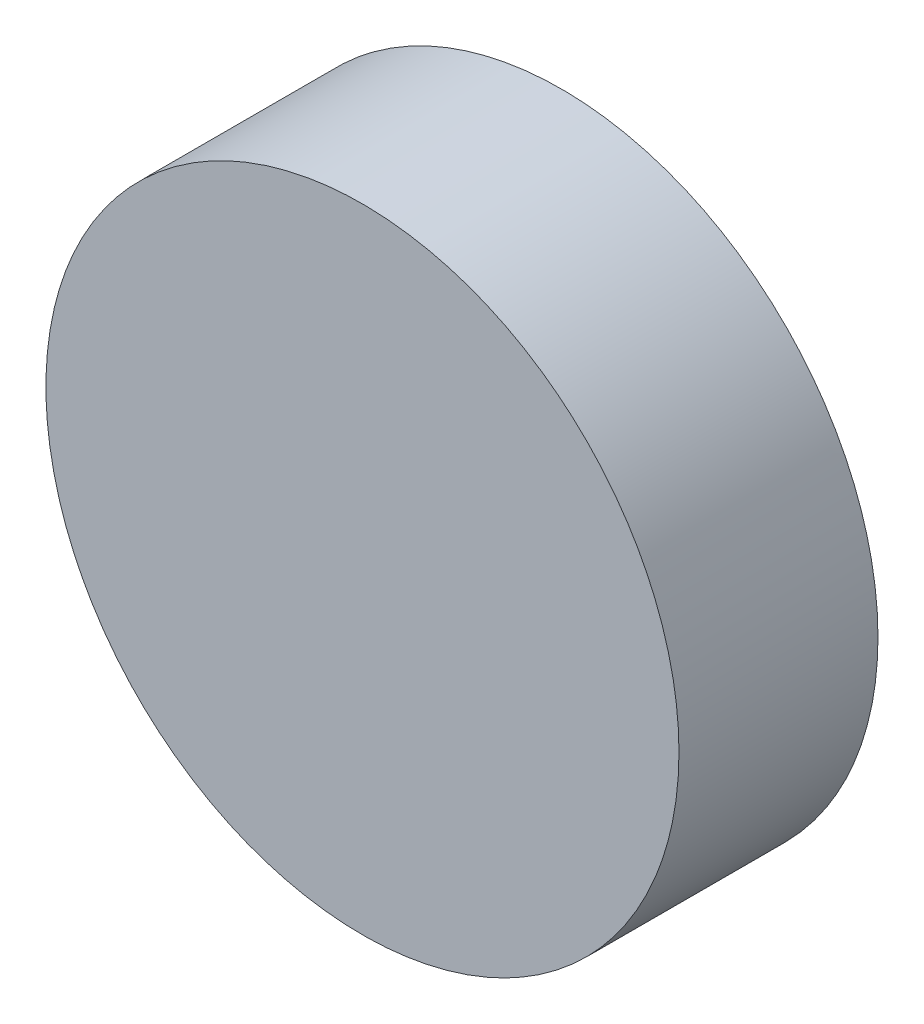
ISO-10303-21;
HEADER;
FILE_DESCRIPTION(('STEP AP214'),'2;1');
FILE_NAME('part.step','',(''),(''),'','','');
FILE_SCHEMA(('AUTOMOTIVE_DESIGN { 1 0 10303 214 1 1 1 1 }'));
ENDSEC;
DATA;
#1=APPLICATION_CONTEXT('core data for automotive mechanical design processes');
#2=APPLICATION_PROTOCOL_DEFINITION('international standard','automotive_design',2000,#1);
#3=PRODUCT_CONTEXT('',#1,'mechanical');
#4=PRODUCT('Part','Part','',(#3));
#5=PRODUCT_RELATED_PRODUCT_CATEGORY('part','',(#4));
#6=PRODUCT_DEFINITION_FORMATION('','',#4);
#7=PRODUCT_DEFINITION_CONTEXT('part definition',#1,'design');
#8=PRODUCT_DEFINITION('design','',#6,#7);
#9=PRODUCT_DEFINITION_SHAPE('','',#8);
#10=(LENGTH_UNIT() NAMED_UNIT(*) SI_UNIT(.MILLI.,.METRE.));
#11=(NAMED_UNIT(*) PLANE_ANGLE_UNIT() SI_UNIT($,.RADIAN.));
#12=(NAMED_UNIT(*) SI_UNIT($,.STERADIAN.) SOLID_ANGLE_UNIT());
#13=UNCERTAINTY_MEASURE_WITH_UNIT(LENGTH_MEASURE(1.E-05),#10,'distance_accuracy_value','');
#14=(GEOMETRIC_REPRESENTATION_CONTEXT(3) GLOBAL_UNCERTAINTY_ASSIGNED_CONTEXT((#13)) GLOBAL_UNIT_ASSIGNED_CONTEXT((#10,
#11,#12)) REPRESENTATION_CONTEXT('',''));
#15=CARTESIAN_POINT('',(0.,0.,0.));
#16=DIRECTION('',(0.,0.,1.));
#17=DIRECTION('',(1.,0.,0.));
#18=AXIS2_PLACEMENT_3D('',#15,#16,#17);
#19=CARTESIAN_POINT('',(711.068615126559,947.806636218316,1405.60786347206));
#20=CARTESIAN_POINT('',(711.068615126559,948.075804185048,1405.60786347206));
#21=CARTESIAN_POINT('',(710.961533451588,948.614140118513,1405.60786347206));
#22=CARTESIAN_POINT('',(710.504119235694,949.298708869946,1405.60786347206));
#23=CARTESIAN_POINT('',(709.819550484261,949.75612308584,1405.60786347206));
#24=CARTESIAN_POINT('',(709.012046584064,949.916745598296,1405.60786347206));
#25=CARTESIAN_POINT('',(708.204542683868,949.75612308584,1405.60786347206));
#26=CARTESIAN_POINT('',(707.519973932435,949.298708869945,1405.60786347206));
#27=CARTESIAN_POINT('',(707.06255971654,948.614140118513,1405.60786347206));
#28=CARTESIAN_POINT('',(706.901937204084,947.806636218316,1405.60786347206));
#29=CARTESIAN_POINT('',(707.06255971654,946.999132318119,1405.60786347206));
#30=CARTESIAN_POINT('',(707.519973932435,946.314563566687,1405.60786347206));
#31=CARTESIAN_POINT('',(708.204542683868,945.857149350792,1405.60786347206));
#32=CARTESIAN_POINT('',(709.012046584064,945.696526838336,1405.60786347206));
#33=CARTESIAN_POINT('',(709.819550484261,945.857149350792,1405.60786347206));
#34=CARTESIAN_POINT('',(710.504119235694,946.314563566687,1405.60786347206));
#35=CARTESIAN_POINT('',(710.961533451588,946.999132318119,1405.60786347206));
#36=CARTESIAN_POINT('',(711.068615126559,947.537468251584,1405.60786347206));
#37=CARTESIAN_POINT('',(711.068615126559,947.806636218316,1405.60786347206));
#38=B_SPLINE_CURVE_WITH_KNOTS('',3,(#19,#20,#21,#22,#23,#24,#25,#26,#27,#28,#29,#30,#31,#32,#33,
#34,#35,#36,#37),.UNSPECIFIED.,.T.,.F.,(4,1,1,1,1,1,1,1,1,1,1,1,1,1,1,1,4),(0.,
0.0624999999999959,0.125,0.187500000000004,0.25,0.312499999999996,0.375,0.437500000000004,0.5,
0.562499999999996,0.625,0.687500000000004,0.75,0.812499999999996,0.875,0.937500000000004,1.),.UNSPECIFIED.);
#39=DIRECTION('',(0.,0.,1.));
#40=VECTOR('',#39,1.);
#41=SURFACE_OF_LINEAR_EXTRUSION('',#38,#40);
#42=CARTESIAN_POINT('',(711.068615126559,947.806636218316,1405.60786347206));
#43=CARTESIAN_POINT('',(711.068615126559,948.075804185048,1405.60786347206));
#44=CARTESIAN_POINT('',(710.961533451588,948.614140118513,1405.60786347206));
#45=CARTESIAN_POINT('',(710.504119235694,949.298708869946,1405.60786347206));
#46=CARTESIAN_POINT('',(709.819550484261,949.75612308584,1405.60786347206));
#47=CARTESIAN_POINT('',(709.012046584064,949.916745598296,1405.60786347206));
#48=CARTESIAN_POINT('',(708.204542683868,949.75612308584,1405.60786347206));
#49=CARTESIAN_POINT('',(707.519973932435,949.298708869945,1405.60786347206));
#50=CARTESIAN_POINT('',(707.06255971654,948.614140118513,1405.60786347206));
#51=CARTESIAN_POINT('',(706.901937204084,947.806636218316,1405.60786347206));
#52=CARTESIAN_POINT('',(707.06255971654,946.999132318119,1405.60786347206));
#53=CARTESIAN_POINT('',(707.519973932435,946.314563566687,1405.60786347206));
#54=CARTESIAN_POINT('',(708.204542683868,945.857149350792,1405.60786347206));
#55=CARTESIAN_POINT('',(709.012046584064,945.696526838336,1405.60786347206));
#56=CARTESIAN_POINT('',(709.819550484261,945.857149350792,1405.60786347206));
#57=CARTESIAN_POINT('',(710.504119235694,946.314563566687,1405.60786347206));
#58=CARTESIAN_POINT('',(710.961533451588,946.999132318119,1405.60786347206));
#59=CARTESIAN_POINT('',(711.068615126559,947.537468251584,1405.60786347206));
#60=CARTESIAN_POINT('',(711.068615126559,947.806636218316,1405.60786347206));
#61=B_SPLINE_CURVE_WITH_KNOTS('',3,(#42,#43,#44,#45,#46,#47,#48,#49,#50,#51,#52,#53,#54,#55,#56,
#57,#58,#59,#60),.UNSPECIFIED.,.T.,.F.,(4,1,1,1,1,1,1,1,1,1,1,1,1,1,1,1,4),(0.,
0.0624999999999959,0.125,0.187500000000004,0.25,0.312499999999996,0.375,0.437500000000004,0.5,
0.562499999999996,0.625,0.687500000000004,0.75,0.812499999999996,0.875,0.937500000000004,1.),.UNSPECIFIED.);
#62=CARTESIAN_POINT('',(711.068615126559,947.806636218316,1405.60786347206));
#63=VERTEX_POINT('',#62);
#64=EDGE_CURVE('E9',#63,#63,#61,.T.);
#65=ORIENTED_EDGE('',*,*,#64,.T.);
#66=EDGE_LOOP('',(#65));
#67=FACE_BOUND('',#66,.T.);
#68=CARTESIAN_POINT('',(711.068615126559,947.806636218316,1406.90071720146));
#69=CARTESIAN_POINT('',(711.068615150918,947.772989428573,1406.90071720146));
#70=CARTESIAN_POINT('',(711.067778514408,947.739343337211,1406.90071720146));
#71=CARTESIAN_POINT('',(711.064448107361,947.672131183194,1406.90071720146));
#72=CARTESIAN_POINT('',(711.061954239332,947.638565125364,1406.90071720146));
#73=CARTESIAN_POINT('',(711.055325333316,947.571593350349,1406.90071720146));
#74=CARTESIAN_POINT('',(711.051190182706,947.538187644325,1406.90071720146));
#75=CARTESIAN_POINT('',(711.041294618915,947.471616400879,1406.90071720146));
#76=CARTESIAN_POINT('',(711.035534135638,947.438450873878,1406.90071720146));
#77=CARTESIAN_POINT('',(711.022403749647,947.372439960422,1406.90071720146));
#78=CARTESIAN_POINT('',(711.015033846935,947.339594573966,1406.90071720146));
#79=CARTESIAN_POINT('',(710.998700436974,947.274303883513,1406.90071720146));
#80=CARTESIAN_POINT('',(710.989736998474,947.241858562319,1406.90071720146));
#81=CARTESIAN_POINT('',(710.970232345742,947.177447989482,1406.90071720146));
#82=CARTESIAN_POINT('',(710.959691239826,947.145482705046,1406.90071720146));
#83=CARTESIAN_POINT('',(710.937047062175,947.082112085445,1406.90071720146));
#84=CARTESIAN_POINT('',(710.924944082366,947.050706717449,1406.90071720146));
#85=CARTESIAN_POINT('',(710.899192252998,946.98853630171,1406.90071720146));
#86=CARTESIAN_POINT('',(710.88554340344,946.957771253966,1406.90071720146));
#87=CARTESIAN_POINT('',(710.856745460104,946.8969496075,1406.90071720146));
#88=CARTESIAN_POINT('',(710.841596278108,946.866893050564,1406.90071720146));
#89=CARTESIAN_POINT('',(710.809842997711,946.807556025715,1406.90071720146));
#90=CARTESIAN_POINT('',(710.793238799529,946.778275611207,1406.90071720146));
#91=CARTESIAN_POINT('',(710.758620773669,946.720558655556,1406.90071720146));
#92=CARTESIAN_POINT('',(710.740606885219,946.692122150867,1406.90071720146));
#93=CARTESIAN_POINT('',(710.703214708772,946.636160804118,1406.90071720146));
#94=CARTESIAN_POINT('',(710.683836420776,946.60863596206,1406.90071720146));
#95=CARTESIAN_POINT('',(710.643760651728,946.554565753817,1406.90071720146));
#96=CARTESIAN_POINT('',(710.623063227613,946.528020345438,1406.90071720146));
#97=CARTESIAN_POINT('',(710.580394419168,946.475976843253,1406.90071720146));
#98=CARTESIAN_POINT('',(710.558423122362,946.450478677701,1406.90071720146));
#99=CARTESIAN_POINT('',(710.513251743854,946.40059741084,1406.90071720146));
#100=CARTESIAN_POINT('',(710.490051734516,946.376214244021,1406.90071720146));
#101=CARTESIAN_POINT('',(710.442468558359,946.328631067864,1406.90071720146));
#102=CARTESIAN_POINT('',(710.41808539154,946.305431058526,1406.90071720146));
#103=CARTESIAN_POINT('',(710.368204124679,946.260259680018,1406.90071720146));
#104=CARTESIAN_POINT('',(710.342705959127,946.238288383212,1406.90071720146));
#105=CARTESIAN_POINT('',(710.290662456942,946.195619574768,1406.90071720146));
#106=CARTESIAN_POINT('',(710.264117048563,946.174922150652,1406.90071720146));
#107=CARTESIAN_POINT('',(710.21004684032,946.134846381604,1406.90071720146));
#108=CARTESIAN_POINT('',(710.182521998262,946.115468093608,1406.90071720146));
#109=CARTESIAN_POINT('',(710.126560651514,946.078075917161,1406.90071720146));
#110=CARTESIAN_POINT('',(710.098124146824,946.060062028711,1406.90071720146));
#111=CARTESIAN_POINT('',(710.040407191172,946.025444002851,1406.90071720146));
#112=CARTESIAN_POINT('',(710.011126776664,946.008839804669,1406.90071720146));
#113=CARTESIAN_POINT('',(709.951789751817,945.977086524271,1406.90071720146));
#114=CARTESIAN_POINT('',(709.921733194883,945.961937342276,1406.90071720146));
#115=CARTESIAN_POINT('',(709.860911548411,945.93313939894,1406.90071720146));
#116=CARTESIAN_POINT('',(709.830146500659,945.919490549383,1406.90071720146));
#117=CARTESIAN_POINT('',(709.767976084941,945.893738720014,1406.90071720146));
#118=CARTESIAN_POINT('',(709.736570716975,945.881635740202,1406.90071720146));
#119=CARTESIAN_POINT('',(709.673200097294,945.858991562556,1406.90071720146));
#120=CARTESIAN_POINT('',(709.641234812749,945.848450456647,1406.90071720146));
#121=CARTESIAN_POINT('',(709.57682424021,945.828945803897,1406.90071720146));
#122=CARTESIAN_POINT('',(709.544378919425,945.819982365373,1406.90071720146));
#123=CARTESIAN_POINT('',(709.479088227857,945.803648955479,1406.90071720146));
#124=CARTESIAN_POINT('',(709.446242839879,945.796279052858,1406.90071720146));
#125=CARTESIAN_POINT('',(709.380231930581,945.783148666617,1406.90071720146));
#126=CARTESIAN_POINT('',(709.34706640926,945.777388182996,1406.90071720146));
#127=CARTESIAN_POINT('',(709.280495150296,945.767492620142,1406.90071720146));
#128=CARTESIAN_POINT('',(709.247089423077,945.763357470814,1406.90071720146));
#129=CARTESIAN_POINT('',(709.180117705969,945.756728561299,1406.90071720146));
#130=CARTESIAN_POINT('',(709.146551727237,945.754234688492,1406.90071720146));
#131=CARTESIAN_POINT('',(709.079339357126,945.750904294499,1406.90071720146));
#132=CARTESIAN_POINT('',(709.045692970595,945.750067675821,1406.90071720146));
#133=CARTESIAN_POINT('',(708.978400197533,945.750067675821,1406.90071720146));
#134=CARTESIAN_POINT('',(708.944753811002,945.750904294499,1406.90071720146));
#135=CARTESIAN_POINT('',(708.877541440892,945.754234688492,1406.90071720146));
#136=CARTESIAN_POINT('',(708.84397546216,945.756728561299,1406.90071720146));
#137=CARTESIAN_POINT('',(708.777003745052,945.763357470814,1406.90071720146));
#138=CARTESIAN_POINT('',(708.743598017832,945.767492620143,1406.90071720146));
#139=CARTESIAN_POINT('',(708.677026758869,945.777388182997,1406.90071720146));
#140=CARTESIAN_POINT('',(708.643861237548,945.783148666617,1406.90071720146));
#141=CARTESIAN_POINT('',(708.577850328249,945.796279052858,1406.90071720146));
#142=CARTESIAN_POINT('',(708.545004940272,945.803648955479,1406.90071720146));
#143=CARTESIAN_POINT('',(708.479714248704,945.819982365373,1406.90071720146));
#144=CARTESIAN_POINT('',(708.447268927919,945.828945803897,1406.90071720146));
#145=CARTESIAN_POINT('',(708.38285835538,945.848450456648,1406.90071720146));
#146=CARTESIAN_POINT('',(708.350893070834,945.858991562557,1406.90071720146));
#147=CARTESIAN_POINT('',(708.287522451153,945.881635740203,1406.90071720146));
#148=CARTESIAN_POINT('',(708.256117083187,945.893738720014,1406.90071720146));
#149=CARTESIAN_POINT('',(708.193946667469,945.919490549383,1406.90071720146));
#150=CARTESIAN_POINT('',(708.163181619718,945.93313939894,1406.90071720146));
#151=CARTESIAN_POINT('',(708.102359973246,945.961937342276,1406.90071720146));
#152=CARTESIAN_POINT('',(708.072303416311,945.977086524272,1406.90071720146));
#153=CARTESIAN_POINT('',(708.012966391464,946.008839804669,1406.90071720146));
#154=CARTESIAN_POINT('',(707.983685976956,946.025444002851,1406.90071720146));
#155=CARTESIAN_POINT('',(707.925969021305,946.060062028712,1406.90071720146));
#156=CARTESIAN_POINT('',(707.897532516615,946.078075917161,1406.90071720146));
#157=CARTESIAN_POINT('',(707.841571169867,946.115468093608,1406.90071720146));
#158=CARTESIAN_POINT('',(707.814046327808,946.134846381604,1406.90071720146));
#159=CARTESIAN_POINT('',(707.759976119565,946.174922150652,1406.90071720146));
#160=CARTESIAN_POINT('',(707.733430711186,946.195619574768,1406.90071720146));
#161=CARTESIAN_POINT('',(707.681387209002,946.238288383212,1406.90071720146));
#162=CARTESIAN_POINT('',(707.655889043449,946.260259680018,1406.90071720146));
#163=CARTESIAN_POINT('',(707.606007776589,946.305431058526,1406.90071720146));
#164=CARTESIAN_POINT('',(707.58162460977,946.328631067864,1406.90071720146));
#165=CARTESIAN_POINT('',(707.534041433613,946.376214244021,1406.90071720146));
#166=CARTESIAN_POINT('',(707.510841424275,946.40059741084,1406.90071720146));
#167=CARTESIAN_POINT('',(707.465670045766,946.450478677701,1406.90071720146));
#168=CARTESIAN_POINT('',(707.443698748961,946.475976843253,1406.90071720146));
#169=CARTESIAN_POINT('',(707.401029940516,946.528020345438,1406.90071720146));
#170=CARTESIAN_POINT('',(707.3803325164,946.554565753817,1406.90071720146));
#171=CARTESIAN_POINT('',(707.340256747353,946.60863596206,1406.90071720146));
#172=CARTESIAN_POINT('',(707.320878459356,946.636160804119,1406.90071720146));
#173=CARTESIAN_POINT('',(707.28348628291,946.692122150867,1406.90071720146));
#174=CARTESIAN_POINT('',(707.26547239446,946.720558655556,1406.90071720146));
#175=CARTESIAN_POINT('',(707.2308543686,946.778275611208,1406.90071720146));
#176=CARTESIAN_POINT('',(707.214250170418,946.807556025716,1406.90071720146));
#177=CARTESIAN_POINT('',(707.18249689002,946.866893050563,1406.90071720146));
#178=CARTESIAN_POINT('',(707.167347708025,946.896949607497,1406.90071720146));
#179=CARTESIAN_POINT('',(707.138549764688,946.957771253969,1406.90071720146));
#180=CARTESIAN_POINT('',(707.124900915131,946.988536301721,1406.90071720146));
#181=CARTESIAN_POINT('',(707.099149085762,947.050706717439,1406.90071720146));
#182=CARTESIAN_POINT('',(707.087046105951,947.082112085405,1406.90071720146));
#183=CARTESIAN_POINT('',(707.064401928305,947.145482705086,1406.90071720146));
#184=CARTESIAN_POINT('',(707.053860822396,947.177447989631,1406.90071720146));
#185=CARTESIAN_POINT('',(707.034356169645,947.24185856217,1406.90071720146));
#186=CARTESIAN_POINT('',(707.025392731121,947.274303882955,1406.90071720146));
#187=CARTESIAN_POINT('',(707.009059321227,947.339594574523,1406.90071720146));
#188=CARTESIAN_POINT('',(707.001689418607,947.372439962501,1406.90071720146));
#189=CARTESIAN_POINT('',(706.988559032365,947.438450871799,1406.90071720146));
#190=CARTESIAN_POINT('',(706.982798548745,947.47161639312,1406.90071720146));
#191=CARTESIAN_POINT('',(706.972902985891,947.538187652084,1406.90071720146));
#192=CARTESIAN_POINT('',(706.968767836562,947.571593379303,1406.90071720146));
#193=CARTESIAN_POINT('',(706.962138927047,947.638565096411,1406.90071720146));
#194=CARTESIAN_POINT('',(706.95964505424,947.672131075144,1406.90071720146));
#195=CARTESIAN_POINT('',(706.956314660247,947.739343445254,1406.90071720146));
#196=CARTESIAN_POINT('',(706.955478041569,947.772989831785,1406.90071720146));
#197=CARTESIAN_POINT('',(706.955478041569,947.840282604847,1406.90071720146));
#198=CARTESIAN_POINT('',(706.956314660247,947.873928991378,1406.90071720146));
#199=CARTESIAN_POINT('',(706.95964505424,947.941141361488,1406.90071720146));
#200=CARTESIAN_POINT('',(706.962138927047,947.974707340221,1406.90071720146));
#201=CARTESIAN_POINT('',(706.968767836562,948.041679057328,1406.90071720146));
#202=CARTESIAN_POINT('',(706.972902985891,948.075084784548,1406.90071720146));
#203=CARTESIAN_POINT('',(706.982798548745,948.141656043511,1406.90071720146));
#204=CARTESIAN_POINT('',(706.988559032365,948.174821564833,1406.90071720146));
#205=CARTESIAN_POINT('',(707.001689418607,948.240832474131,1406.90071720146));
#206=CARTESIAN_POINT('',(707.009059321228,948.273677862108,1406.90071720146));
#207=CARTESIAN_POINT('',(707.025392731121,948.338968553676,1406.90071720146));
#208=CARTESIAN_POINT('',(707.034356169646,948.371413874462,1406.90071720146));
#209=CARTESIAN_POINT('',(707.053860822396,948.435824447001,1406.90071720146));
#210=CARTESIAN_POINT('',(707.064401928305,948.467789731546,1406.90071720146));
#211=CARTESIAN_POINT('',(707.087046105951,948.531160351227,1406.90071720146));
#212=CARTESIAN_POINT('',(707.099149085762,948.562565719193,1406.90071720146));
#213=CARTESIAN_POINT('',(707.124900915131,948.624736134911,1406.90071720146));
#214=CARTESIAN_POINT('',(707.138549764688,948.655501182663,1406.90071720146));
#215=CARTESIAN_POINT('',(707.167347708025,948.716322829135,1406.90071720146));
#216=CARTESIAN_POINT('',(707.18249689002,948.746379386069,1406.90071720146));
#217=CARTESIAN_POINT('',(707.214250170418,948.805716410916,1406.90071720146));
#218=CARTESIAN_POINT('',(707.2308543686,948.834996825424,1406.90071720146));
#219=CARTESIAN_POINT('',(707.26547239446,948.892713781076,1406.90071720146));
#220=CARTESIAN_POINT('',(707.28348628291,948.921150285765,1406.90071720146));
#221=CARTESIAN_POINT('',(707.320878459356,948.977111632513,1406.90071720146));
#222=CARTESIAN_POINT('',(707.340256747353,949.004636474572,1406.90071720146));
#223=CARTESIAN_POINT('',(707.3803325164,949.058706682815,1406.90071720146));
#224=CARTESIAN_POINT('',(707.401029940516,949.085252091194,1406.90071720146));
#225=CARTESIAN_POINT('',(707.443698748961,949.137295593378,1406.90071720146));
#226=CARTESIAN_POINT('',(707.465670045766,949.162793758931,1406.90071720146));
#227=CARTESIAN_POINT('',(707.510841424275,949.212675025792,1406.90071720146));
#228=CARTESIAN_POINT('',(707.534041433613,949.237058192611,1406.90071720146));
#229=CARTESIAN_POINT('',(707.58162460977,949.284641368768,1406.90071720146));
#230=CARTESIAN_POINT('',(707.606007776588,949.307841378106,1406.90071720146));
#231=CARTESIAN_POINT('',(707.65588904345,949.353012756614,1406.90071720146));
#232=CARTESIAN_POINT('',(707.681387209002,949.37498405342,1406.90071720146));
#233=CARTESIAN_POINT('',(707.733430711186,949.417652861864,1406.90071720146));
#234=CARTESIAN_POINT('',(707.759976119565,949.43835028598,1406.90071720146));
#235=CARTESIAN_POINT('',(707.814046327808,949.478426055028,1406.90071720146));
#236=CARTESIAN_POINT('',(707.841571169867,949.497804343024,1406.90071720146));
#237=CARTESIAN_POINT('',(707.897532516615,949.53519651947,1406.90071720146));
#238=CARTESIAN_POINT('',(707.925969021304,949.55321040792,1406.90071720146));
#239=CARTESIAN_POINT('',(707.983685976956,949.587828433781,1406.90071720146));
#240=CARTESIAN_POINT('',(708.012966391464,949.604432631962,1406.90071720146));
#241=CARTESIAN_POINT('',(708.072303416311,949.63618591236,1406.90071720146));
#242=CARTESIAN_POINT('',(708.102359973245,949.651335094356,1406.90071720146));
#243=CARTESIAN_POINT('',(708.163181619718,949.680133037692,1406.90071720146));
#244=CARTESIAN_POINT('',(708.193946667469,949.693781887249,1406.90071720146));
#245=CARTESIAN_POINT('',(708.256117083187,949.719533716618,1406.90071720146));
#246=CARTESIAN_POINT('',(708.287522451153,949.731636696429,1406.90071720146));
#247=CARTESIAN_POINT('',(708.350893070834,949.754280874075,1406.90071720146));
#248=CARTESIAN_POINT('',(708.38285835538,949.764821979984,1406.90071720146));
#249=CARTESIAN_POINT('',(708.447268927919,949.784326632735,1406.90071720146));
#250=CARTESIAN_POINT('',(708.479714248704,949.793290071259,1406.90071720146));
#251=CARTESIAN_POINT('',(708.545004940272,949.809623481153,1406.90071720146));
#252=CARTESIAN_POINT('',(708.577850328249,949.816993383773,1406.90071720146));
#253=CARTESIAN_POINT('',(708.643861237548,949.830123770015,1406.90071720146));
#254=CARTESIAN_POINT('',(708.677026758869,949.835884253636,1406.90071720146));
#255=CARTESIAN_POINT('',(708.743598017832,949.845779816489,1406.90071720146));
#256=CARTESIAN_POINT('',(708.777003745052,949.849914965818,1406.90071720146));
#257=CARTESIAN_POINT('',(708.843975462159,949.856543875333,1406.90071720146));
#258=CARTESIAN_POINT('',(708.877541440892,949.85903774814,1406.90071720146));
#259=CARTESIAN_POINT('',(708.944753811002,949.862368142133,1406.90071720146));
#260=CARTESIAN_POINT('',(708.978400197533,949.863204760811,1406.90071720146));
#261=CARTESIAN_POINT('',(709.045692970595,949.863204760811,1406.90071720146));
#262=CARTESIAN_POINT('',(709.079339357126,949.862368142133,1406.90071720146));
#263=CARTESIAN_POINT('',(709.146551727236,949.85903774814,1406.90071720146));
#264=CARTESIAN_POINT('',(709.180117705969,949.856543875333,1406.90071720146));
#265=CARTESIAN_POINT('',(709.247089423077,949.849914965818,1406.90071720146));
#266=CARTESIAN_POINT('',(709.280495150296,949.845779816489,1406.90071720146));
#267=CARTESIAN_POINT('',(709.34706640926,949.835884253635,1406.90071720146));
#268=CARTESIAN_POINT('',(709.380231930581,949.830123770015,1406.90071720146));
#269=CARTESIAN_POINT('',(709.446242839879,949.816993383773,1406.90071720146));
#270=CARTESIAN_POINT('',(709.479088227857,949.809623481152,1406.90071720146));
#271=CARTESIAN_POINT('',(709.544378919424,949.793290071259,1406.90071720146));
#272=CARTESIAN_POINT('',(709.57682424021,949.784326632735,1406.90071720146));
#273=CARTESIAN_POINT('',(709.641234812749,949.764821979984,1406.90071720146));
#274=CARTESIAN_POINT('',(709.673200097294,949.754280874075,1406.90071720146));
#275=CARTESIAN_POINT('',(709.736570716975,949.731636696429,1406.90071720146));
#276=CARTESIAN_POINT('',(709.767976084941,949.719533716618,1406.90071720146));
#277=CARTESIAN_POINT('',(709.830146500659,949.693781887249,1406.90071720146));
#278=CARTESIAN_POINT('',(709.860911548411,949.680133037692,1406.90071720146));
#279=CARTESIAN_POINT('',(709.921733194883,949.651335094356,1406.90071720146));
#280=CARTESIAN_POINT('',(709.951789751817,949.63618591236,1406.90071720146));
#281=CARTESIAN_POINT('',(710.011126776664,949.604432631962,1406.90071720146));
#282=CARTESIAN_POINT('',(710.040407191172,949.58782843378,1406.90071720146));
#283=CARTESIAN_POINT('',(710.098124146824,949.55321040792,1406.90071720146));
#284=CARTESIAN_POINT('',(710.126560651514,949.53519651947,1406.90071720146));
#285=CARTESIAN_POINT('',(710.182521998262,949.497804343024,1406.90071720146));
#286=CARTESIAN_POINT('',(710.21004684032,949.478426055027,1406.90071720146));
#287=CARTESIAN_POINT('',(710.264117048563,949.43835028598,1406.90071720146));
#288=CARTESIAN_POINT('',(710.290662456942,949.417652861864,1406.90071720146));
#289=CARTESIAN_POINT('',(710.342705959127,949.37498405342,1406.90071720146));
#290=CARTESIAN_POINT('',(710.368204124679,949.353012756614,1406.90071720146));
#291=CARTESIAN_POINT('',(710.41808539154,949.307841378106,1406.90071720146));
#292=CARTESIAN_POINT('',(710.442468558359,949.284641368768,1406.90071720146));
#293=CARTESIAN_POINT('',(710.490051734516,949.237058192611,1406.90071720146));
#294=CARTESIAN_POINT('',(710.513251743854,949.212675025792,1406.90071720146));
#295=CARTESIAN_POINT('',(710.558423122362,949.162793758931,1406.90071720146));
#296=CARTESIAN_POINT('',(710.580394419168,949.137295593378,1406.90071720146));
#297=CARTESIAN_POINT('',(710.623063227613,949.085252091194,1406.90071720146));
#298=CARTESIAN_POINT('',(710.643760651728,949.058706682815,1406.90071720146));
#299=CARTESIAN_POINT('',(710.683836420776,949.004636474572,1406.90071720146));
#300=CARTESIAN_POINT('',(710.703214708772,948.977111632514,1406.90071720146));
#301=CARTESIAN_POINT('',(710.740606885219,948.921150285765,1406.90071720146));
#302=CARTESIAN_POINT('',(710.758620773668,948.892713781076,1406.90071720146));
#303=CARTESIAN_POINT('',(710.793238799529,948.834996825425,1406.90071720146));
#304=CARTESIAN_POINT('',(710.809842997711,948.805716410917,1406.90071720146));
#305=CARTESIAN_POINT('',(710.841596278108,948.746379386068,1406.90071720146));
#306=CARTESIAN_POINT('',(710.856745460103,948.716322829132,1406.90071720146));
#307=CARTESIAN_POINT('',(710.88554340344,948.655501182665,1406.90071720146));
#308=CARTESIAN_POINT('',(710.899192252998,948.624736134922,1406.90071720146));
#309=CARTESIAN_POINT('',(710.924944082366,948.562565719182,1406.90071720146));
#310=CARTESIAN_POINT('',(710.937047062175,948.531160351187,1406.90071720146));
#311=CARTESIAN_POINT('',(710.959691239826,948.467789731586,1406.90071720146));
#312=CARTESIAN_POINT('',(710.970232345741,948.43582444715,1406.90071720146));
#313=CARTESIAN_POINT('',(710.989736998474,948.371413874312,1406.90071720146));
#314=CARTESIAN_POINT('',(710.998700436973,948.338968553119,1406.90071720146));
#315=CARTESIAN_POINT('',(711.015033846934,948.273677862666,1406.90071720146));
#316=CARTESIAN_POINT('',(711.022403749647,948.24083247621,1406.90071720146));
#317=CARTESIAN_POINT('',(711.035534135637,948.174821562754,1406.90071720146));
#318=CARTESIAN_POINT('',(711.041294618915,948.141656035753,1406.90071720146));
#319=CARTESIAN_POINT('',(711.051190182706,948.075084792307,1406.90071720146));
#320=CARTESIAN_POINT('',(711.055325333316,948.041679086283,1406.90071720146));
#321=CARTESIAN_POINT('',(711.061954239332,947.974707311268,1406.90071720146));
#322=CARTESIAN_POINT('',(711.064448107361,947.941141253438,1406.90071720146));
#323=CARTESIAN_POINT('',(711.067778514408,947.873929099421,1406.90071720146));
#324=CARTESIAN_POINT('',(711.068615150918,947.840283008059,1406.90071720146));
#325=CARTESIAN_POINT('',(711.068615126559,947.806636218316,1406.90071720146));
#326=B_SPLINE_CURVE_WITH_KNOTS('',3,(#68,#69,#70,#71,#72,#73,#74,#75,#76,#77,#78,#79,#80,#81,
#82,#83,#84,#85,#86,#87,#88,#89,#90,#91,#92,#93,#94,#95,#96,#97,#98,#99,#100,#101,#102,#103,
#104,#105,#106,#107,#108,#109,#110,#111,#112,#113,#114,#115,#116,#117,#118,#119,#120,#121,#122,
#123,#124,#125,#126,#127,#128,#129,#130,#131,#132,#133,#134,#135,#136,#137,#138,#139,#140,#141,
#142,#143,#144,#145,#146,#147,#148,#149,#150,#151,#152,#153,#154,#155,#156,#157,#158,#159,#160,
#161,#162,#163,#164,#165,#166,#167,#168,#169,#170,#171,#172,#173,#174,#175,#176,#177,#178,#179,
#180,#181,#182,#183,#184,#185,#186,#187,#188,#189,#190,#191,#192,#193,#194,#195,#196,#197,#198,
#199,#200,#201,#202,#203,#204,#205,#206,#207,#208,#209,#210,#211,#212,#213,#214,#215,#216,#217,
#218,#219,#220,#221,#222,#223,#224,#225,#226,#227,#228,#229,#230,#231,#232,#233,#234,#235,#236,
#237,#238,#239,#240,#241,#242,#243,#244,#245,#246,#247,#248,#249,#250,#251,#252,#253,#254,#255,
#256,#257,#258,#259,#260,#261,#262,#263,#264,#265,#266,#267,#268,#269,#270,#271,#272,#273,#274,
#275,#276,#277,#278,#279,#280,#281,#282,#283,#284,#285,#286,#287,#288,#289,#290,#291,#292,#293,
#294,#295,#296,#297,#298,#299,#300,#301,#302,#303,#304,#305,#306,#307,#308,#309,#310,#311,#312,
#313,#314,#315,#316,#317,#318,#319,#320,#321,#322,#323,#324,#325),.UNSPECIFIED.,.F.,.F.,(4,2,2,
2,2,2,2,2,2,2,2,2,2,2,2,2,2,2,2,2,2,2,2,2,2,2,2,2,2,2,2,2,2,2,2,2,2,2,2,2,2,2,2,2,2,2,2,2,2,2,2,
2,2,2,2,2,2,2,2,2,2,2,2,2,2,2,2,2,2,2,2,2,2,2,2,2,2,2,2,2,2,2,2,2,2,2,2,2,2,2,2,2,2,2,2,2,2,2,2,
2,2,2,2,2,2,2,2,2,2,2,2,2,2,2,2,2,2,2,2,2,2,2,2,2,2,2,2,2,4),(0.,0.100928980478589,
0.201863898895294,0.302805744465219,0.403751944002731,0.50469814354005,0.605639989110097,
0.706574907526805,0.80750388800547,0.908432868483907,1.00936778690069,1.11030963247059,
1.21125583200794,1.31220203154545,1.41314387711524,1.51407879553216,1.61500777601072,
1.7159367564892,1.81687167490612,1.91781352047622,2.01875972001355,2.11970591955083,
2.22064776512079,2.32158268353758,2.42251166401606,2.52344064449466,2.62437556291147,
2.72531740848144,2.82626360801871,2.92720980755604,3.0281516531259,3.12908657154261,
3.23001555202121,3.3309445324998,3.43187945091662,3.53282129648653,3.63376749602394,
3.73471369556123,3.83565554113109,3.93659045954808,4.03751944002658,4.13844842050506,
4.23938333892189,4.3403251844918,4.44127138402914,4.54221758356649,4.64315942913646,
4.7440943475533,4.84502332803178,4.94595230851027,5.04688722692727,5.14782907249731,
5.24877527203456,5.34972147157166,5.45066331714182,5.5515982355585,5.65252721603714,
5.75345619651556,5.85439111493241,5.9553329605023,6.05627916003976,6.15722535957711,
6.25816720514709,6.35910212356402,6.46003110404261,6.56096008452098,6.6618950029378,
6.76283684850792,6.86378304804523,6.96472924758231,7.06567109315235,7.16660601156931,
7.26753499204762,7.36846397252631,7.46939889094324,7.57034073651309,7.67128693605038,
7.77223313558763,7.87317498115774,7.97410989957434,8.07503888005314,8.17596786053171,
8.27690277894864,8.37784462451842,8.47879082405567,8.57973702359296,8.68067886916311,
8.78161378757985,8.88254276805839,8.98347174853691,9.08440666695386,9.1853485125238,
9.28629471206107,9.3872409115984,9.48818275716841,9.58911767558512,9.6900466560636,
9.79097563654208,9.8919105549589,9.99285240052881,10.0937986000664,10.1947447996034,
10.2956866451736,10.3966215635903,10.4975505440689,10.5984795245474,10.6994144429642,
10.8003562885342,10.9013024880715,11.002248687609,11.1031905331789,11.2041254515957,
11.3050544320742,11.4059834125527,11.5069183309698,11.6078601765395,11.7088063760768,
11.809752575614,11.9106944211841,12.0116293396009,12.1125583200794,12.2134873005581,
12.3144222189748,12.4153640645448,12.5163102640822,12.6172564636193,12.7181983091895,
12.8191332276062,12.9200622080848),.UNSPECIFIED.);
#327=CARTESIAN_POINT('',(711.068615126559,947.806636218316,1406.90071720146));
#328=VERTEX_POINT('',#327);
#329=EDGE_CURVE('E24',#328,#328,#326,.F.);
#330=ORIENTED_EDGE('',*,*,#329,.F.);
#331=EDGE_LOOP('',(#330));
#332=FACE_BOUND('',#331,.T.);
#333=ADVANCED_FACE('F14',(#67,#332),#41,.T.);
#334=CARTESIAN_POINT('',(707.012046584064,947.806636218316,1405.60786347206));
#335=DIRECTION('',(0.,0.,1.));
#336=DIRECTION('',(0.,-1.,0.));
#337=AXIS2_PLACEMENT_3D('',#334,#335,#336);
#338=PLANE('',#337);
#339=ORIENTED_EDGE('',*,*,#64,.F.);
#340=EDGE_LOOP('',(#339));
#341=FACE_BOUND('',#340,.T.);
#342=ADVANCED_FACE('F62',(#341),#338,.F.);
#343=CARTESIAN_POINT('',(707.012046584064,947.806636218316,1406.90071720146));
#344=DIRECTION('',(0.,0.,1.));
#345=DIRECTION('',(0.,-1.,0.));
#346=AXIS2_PLACEMENT_3D('',#343,#344,#345);
#347=PLANE('',#346);
#348=ORIENTED_EDGE('',*,*,#329,.T.);
#349=EDGE_LOOP('',(#348));
#350=FACE_BOUND('',#349,.T.);
#351=ADVANCED_FACE('F31',(#350),#347,.T.);
#352=CLOSED_SHELL('',(#333,#342,#351));
#353=MANIFOLD_SOLID_BREP('B1',#352);
#354=ADVANCED_BREP_SHAPE_REPRESENTATION('',(#18,#353),#14);
#355=SHAPE_DEFINITION_REPRESENTATION(#9,#354);
ENDSEC;
END-ISO-10303-21;
